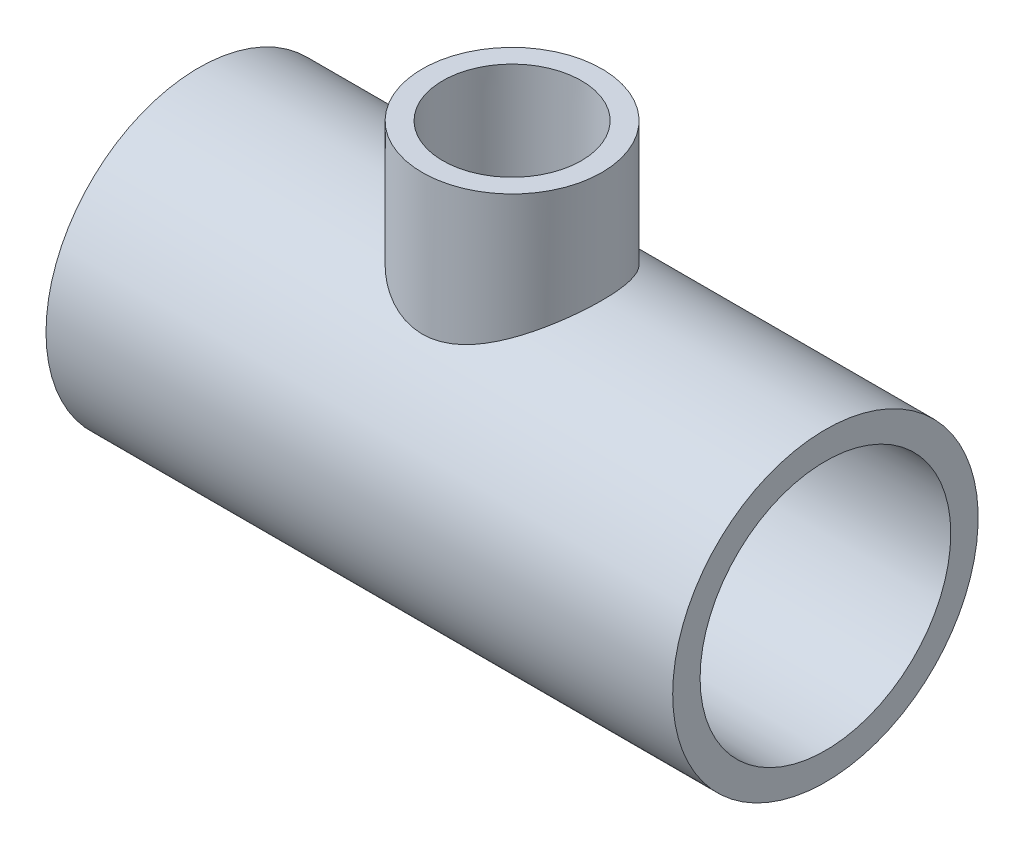
ISO-10303-21;
HEADER;
FILE_DESCRIPTION(('STEP AP214'),'2;1');
FILE_NAME('part.step','',(''),(''),'','','');
FILE_SCHEMA(('AUTOMOTIVE_DESIGN { 1 0 10303 214 1 1 1 1 }'));
ENDSEC;
DATA;
#1=APPLICATION_CONTEXT('core data for automotive mechanical design processes');
#2=APPLICATION_PROTOCOL_DEFINITION('international standard','automotive_design',2000,#1);
#3=PRODUCT_CONTEXT('',#1,'mechanical');
#4=PRODUCT('Part','Part','',(#3));
#5=PRODUCT_RELATED_PRODUCT_CATEGORY('part','',(#4));
#6=PRODUCT_DEFINITION_FORMATION('','',#4);
#7=PRODUCT_DEFINITION_CONTEXT('part definition',#1,'design');
#8=PRODUCT_DEFINITION('design','',#6,#7);
#9=PRODUCT_DEFINITION_SHAPE('','',#8);
#10=(LENGTH_UNIT() NAMED_UNIT(*) SI_UNIT(.MILLI.,.METRE.));
#11=(NAMED_UNIT(*) PLANE_ANGLE_UNIT() SI_UNIT($,.RADIAN.));
#12=(NAMED_UNIT(*) SI_UNIT($,.STERADIAN.) SOLID_ANGLE_UNIT());
#13=UNCERTAINTY_MEASURE_WITH_UNIT(LENGTH_MEASURE(1.E-05),#10,'distance_accuracy_value','');
#14=(GEOMETRIC_REPRESENTATION_CONTEXT(3) GLOBAL_UNCERTAINTY_ASSIGNED_CONTEXT((#13)) GLOBAL_UNIT_ASSIGNED_CONTEXT((#10,
#11,#12)) REPRESENTATION_CONTEXT('',''));
#15=CARTESIAN_POINT('',(0.,0.,0.));
#16=DIRECTION('',(0.,0.,1.));
#17=DIRECTION('',(1.,0.,0.));
#18=AXIS2_PLACEMENT_3D('',#15,#16,#17);
#19=CARTESIAN_POINT('',(-25.908,0.,0.));
#20=DIRECTION('',(1.,0.,0.));
#21=DIRECTION('',(0.,0.,-1.));
#22=AXIS2_PLACEMENT_3D('',#19,#20,#21);
#23=PLANE('',#22);
#24=CARTESIAN_POINT('',(-25.908,0.,0.));
#25=DIRECTION('',(-1.,0.,0.));
#26=DIRECTION('',(0.,0.,1.));
#27=AXIS2_PLACEMENT_3D('',#24,#25,#26);
#28=CIRCLE('',#27,24.0538);
#29=CARTESIAN_POINT('',(-25.908,0.,24.0538));
#30=VERTEX_POINT('',#29);
#31=EDGE_CURVE('E90',#30,#30,#28,.T.);
#32=ORIENTED_EDGE('',*,*,#31,.T.);
#33=EDGE_LOOP('',(#32));
#34=FACE_BOUND('',#33,.T.);
#35=CARTESIAN_POINT('',(-25.908,0.,0.));
#36=DIRECTION('',(1.,0.,0.));
#37=DIRECTION('',(0.,0.,-1.));
#38=AXIS2_PLACEMENT_3D('',#35,#36,#37);
#39=CIRCLE('',#38,19.05);
#40=CARTESIAN_POINT('',(-25.908,0.,-19.05));
#41=VERTEX_POINT('',#40);
#42=EDGE_CURVE('E93',#41,#41,#39,.T.);
#43=ORIENTED_EDGE('',*,*,#42,.T.);
#44=EDGE_LOOP('',(#43));
#45=FACE_BOUND('',#44,.T.);
#46=ADVANCED_FACE('F28',(#34,#45),#23,.F.);
#47=CARTESIAN_POINT('',(25.908,0.,0.));
#48=DIRECTION('',(1.,0.,0.));
#49=DIRECTION('',(0.,0.,-1.));
#50=AXIS2_PLACEMENT_3D('',#47,#48,#49);
#51=PLANE('',#50);
#52=CARTESIAN_POINT('',(25.908,0.,0.));
#53=DIRECTION('',(1.,0.,0.));
#54=DIRECTION('',(0.,0.,-1.));
#55=AXIS2_PLACEMENT_3D('',#52,#53,#54);
#56=CIRCLE('',#55,24.0538);
#57=CARTESIAN_POINT('',(25.908,0.,-24.0538));
#58=VERTEX_POINT('',#57);
#59=EDGE_CURVE('E10',#58,#58,#56,.F.);
#60=ORIENTED_EDGE('',*,*,#59,.F.);
#61=EDGE_LOOP('',(#60));
#62=FACE_BOUND('',#61,.T.);
#63=CARTESIAN_POINT('',(25.908,0.,0.));
#64=DIRECTION('',(1.,0.,0.));
#65=DIRECTION('',(0.,0.,-1.));
#66=AXIS2_PLACEMENT_3D('',#63,#64,#65);
#67=CIRCLE('',#66,19.05);
#68=CARTESIAN_POINT('',(25.908,0.,-19.05));
#69=VERTEX_POINT('',#68);
#70=EDGE_CURVE('E96',#69,#69,#67,.T.);
#71=ORIENTED_EDGE('',*,*,#70,.F.);
#72=EDGE_LOOP('',(#71));
#73=FACE_BOUND('',#72,.T.);
#74=ADVANCED_FACE('F66',(#62,#73),#51,.T.);
#75=CARTESIAN_POINT('',(25.908,0.,0.));
#76=DIRECTION('',(-1.,0.,0.));
#77=DIRECTION('',(0.,0.,1.));
#78=AXIS2_PLACEMENT_3D('',#75,#76,#77);
#79=CYLINDRICAL_SURFACE('',#78,29.591);
#80=CARTESIAN_POINT('',(-60.706,0.,0.));
#81=DIRECTION('',(-1.,0.,0.));
#82=DIRECTION('',(0.,0.,1.));
#83=AXIS2_PLACEMENT_3D('',#80,#81,#82);
#84=CIRCLE('',#83,29.591);
#85=CARTESIAN_POINT('',(-60.706,0.,29.591));
#86=VERTEX_POINT('',#85);
#87=EDGE_CURVE('E107',#86,#86,#84,.T.);
#88=ORIENTED_EDGE('',*,*,#87,.F.);
#89=EDGE_LOOP('',(#88));
#90=FACE_BOUND('',#89,.T.);
#91=CARTESIAN_POINT('',(60.706,0.,0.));
#92=DIRECTION('',(-1.,0.,0.));
#93=DIRECTION('',(0.,0.,1.));
#94=AXIS2_PLACEMENT_3D('',#91,#92,#93);
#95=CIRCLE('',#94,29.591);
#96=CARTESIAN_POINT('',(60.706,0.,29.591));
#97=VERTEX_POINT('',#96);
#98=EDGE_CURVE('E95',#97,#97,#95,.T.);
#99=ORIENTED_EDGE('',*,*,#98,.T.);
#100=EDGE_LOOP('',(#99));
#101=FACE_BOUND('',#100,.T.);
#102=CARTESIAN_POINT('',(17.399,29.591,0.));
#103=CARTESIAN_POINT('',(17.3989965746656,29.5909968547931,-0.446664263788673));
#104=CARTESIAN_POINT('',(17.3817716950422,29.5808599173466,-0.893483619711497));
#105=CARTESIAN_POINT('',(17.3130851748739,29.5405525594495,-1.78377449229501));
#106=CARTESIAN_POINT('',(17.2616010772573,29.5103689983717,-2.22724361989634));
#107=CARTESIAN_POINT('',(17.1249205436222,29.4306285259771,-3.10829157522697));
#108=CARTESIAN_POINT('',(17.0396434612983,29.381025273377,-3.54585370388858));
#109=CARTESIAN_POINT('',(16.8365009384491,29.2636801942943,-4.41075641610078));
#110=CARTESIAN_POINT('',(16.7186405534614,29.195941181759,-4.83809857418761));
#111=CARTESIAN_POINT('',(16.4523864578326,29.0442970785563,-5.67778349241128));
#112=CARTESIAN_POINT('',(16.3041469685307,28.960473772525,-6.09019009433338));
#113=CARTESIAN_POINT('',(15.9783265080964,28.7783036112216,-6.89991037613747));
#114=CARTESIAN_POINT('',(15.8007445062871,28.6799562457944,-7.29722352524792));
#115=CARTESIAN_POINT('',(15.417952544002,28.4708562205587,-8.07462602232387));
#116=CARTESIAN_POINT('',(15.2127560773021,28.3601096240342,-8.45472366213837));
#117=CARTESIAN_POINT('',(14.7762443765361,28.1283712213738,-9.19635720524652));
#118=CARTESIAN_POINT('',(14.5449265172563,28.0073783857917,-9.55789123756694));
#119=CARTESIAN_POINT('',(14.0394793333617,27.748126558282,-10.2873491853061));
#120=CARTESIAN_POINT('',(13.7634428055843,27.609252931579,-10.6537332565626));
#121=CARTESIAN_POINT('',(13.18465615595,27.3253295974633,-11.3621874909861));
#122=CARTESIAN_POINT('',(12.8819048820624,27.1802796238453,-11.70425660446));
#123=CARTESIAN_POINT('',(12.2508347272961,26.8869278142573,-12.3632776276872));
#124=CARTESIAN_POINT('',(11.9224861199397,26.7386223456033,-12.680199445528));
#125=CARTESIAN_POINT('',(11.2418805583162,26.4421655726438,-13.2873364483088));
#126=CARTESIAN_POINT('',(10.8896223466983,26.2940142768624,-13.5775502268411));
#127=CARTESIAN_POINT('',(10.1199331921776,25.9841669109285,-14.1623528553039));
#128=CARTESIAN_POINT('',(9.69969563382477,25.8229098878933,-14.4534936642856));
#129=CARTESIAN_POINT('',(8.83258042492793,25.5098630349156,-14.9991046605458));
#130=CARTESIAN_POINT('',(8.38569865646792,25.3580746758307,-15.2535691585503));
#131=CARTESIAN_POINT('',(7.46786840915121,25.0695358990769,-15.723280516061));
#132=CARTESIAN_POINT('',(6.99695170011867,24.9327663466049,-15.9385775124567));
#133=CARTESIAN_POINT('',(6.03309183371566,24.6796348682849,-16.3277946055125));
#134=CARTESIAN_POINT('',(5.5401565462078,24.563265723026,-16.5017293474795));
#135=CARTESIAN_POINT('',(4.65275524424181,24.3804848044472,-16.7701845883971));
#136=CARTESIAN_POINT('',(4.26210615512665,24.3087505052862,-16.8737658714764));
#137=CARTESIAN_POINT('',(3.47186551006263,24.182719236169,-17.0538996289054));
#138=CARTESIAN_POINT('',(3.07227531591813,24.1284196298438,-17.130456189945));
#139=CARTESIAN_POINT('',(2.26698346930766,24.0391628728771,-17.2554874469854));
#140=CARTESIAN_POINT('',(1.86128831970376,24.004186456866,-17.3039901152075));
#141=CARTESIAN_POINT('',(1.04622107477816,23.9547744465798,-17.3723302363024));
#142=CARTESIAN_POINT('',(0.636848911491327,23.9403392327732,-17.392167158222));
#143=CARTESIAN_POINT('',(-0.183170986888116,23.9325564723725,-17.402875316488));
#144=CARTESIAN_POINT('',(-0.593819708148509,23.9392446710061,-17.3936974537302));
#145=CARTESIAN_POINT('',(-1.41255916154233,23.9735289517119,-17.346412618511));
#146=CARTESIAN_POINT('',(-1.82064988209232,24.0011251283933,-17.3083055151442));
#147=CARTESIAN_POINT('',(-2.63155660073567,24.0762132177497,-17.2037019825753));
#148=CARTESIAN_POINT('',(-3.03436917745361,24.1237174351664,-17.1371879951888));
#149=CARTESIAN_POINT('',(-3.83185036098813,24.2369410670221,-16.9766777085311));
#150=CARTESIAN_POINT('',(-4.22651877590705,24.3026609101433,-16.8826807624797));
#151=CARTESIAN_POINT('',(-5.00195096147245,24.449497631376,-16.6693111828854));
#152=CARTESIAN_POINT('',(-5.38280893143271,24.5304680884988,-16.5501786651237));
#153=CARTESIAN_POINT('',(-6.13280410945582,24.7058768579449,-16.2871698929305));
#154=CARTESIAN_POINT('',(-6.50193743007998,24.8003195813158,-16.1432855311366));
#155=CARTESIAN_POINT('',(-7.22705000103735,25.0002167198022,-15.8319503259858));
#156=CARTESIAN_POINT('',(-7.5830283203365,25.1056719123027,-15.664497818631));
#157=CARTESIAN_POINT('',(-8.28076069034228,25.3251532026764,-15.3071182552408));
#158=CARTESIAN_POINT('',(-8.62251398891438,25.4391797528598,-15.1171900128574));
#159=CARTESIAN_POINT('',(-9.34743105043381,25.6932408774167,-14.6819075911772));
#160=CARTESIAN_POINT('',(-9.72783341125569,25.834414272369,-14.4326108453873));
#161=CARTESIAN_POINT('',(-10.4667000406405,26.1216007917485,-13.906083949146));
#162=CARTESIAN_POINT('',(-10.8251679811925,26.2676130997607,-13.6288584948509));
#163=CARTESIAN_POINT('',(-11.5194037588907,26.5612446028436,-13.0473653366527));
#164=CARTESIAN_POINT('',(-11.8551494899446,26.7088652050323,-12.7430719462372));
#165=CARTESIAN_POINT('',(-12.5022950243176,27.0023386845443,-12.1088032493395));
#166=CARTESIAN_POINT('',(-12.8136935648323,27.1481914698459,-11.7788266125253));
#167=CARTESIAN_POINT('',(-13.4490747524633,27.4534585372452,-11.050347615996));
#168=CARTESIAN_POINT('',(-13.7695404080466,27.6122098948425,-10.6484864685149));
#169=CARTESIAN_POINT('',(-14.375358588756,27.9192555958272,-9.81527331455823));
#170=CARTESIAN_POINT('',(-14.6607076282546,28.0675489005399,-9.38391838717003));
#171=CARTESIAN_POINT('',(-15.1935550080529,28.3495169359491,-8.49410741444208));
#172=CARTESIAN_POINT('',(-15.441068956411,28.4831976882225,-8.03566265324478));
#173=CARTESIAN_POINT('',(-15.8955648002813,28.7321231201475,-7.09431384450719));
#174=CARTESIAN_POINT('',(-16.1025517538802,28.8473701001493,-6.61141285877658));
#175=CARTESIAN_POINT('',(-16.460957046543,29.0490056131473,-5.65724266500031));
#176=CARTESIAN_POINT('',(-16.6151416690875,29.1367969762516,-5.18730999615828));
#177=CARTESIAN_POINT('',(-16.8835844748139,29.2907048808839,-4.23267677349769));
#178=CARTESIAN_POINT('',(-16.9978439509851,29.3568221243313,-3.74797669847937));
#179=CARTESIAN_POINT('',(-17.1845681925219,29.4653303350277,-2.76842601051983));
#180=CARTESIAN_POINT('',(-17.2570713751992,29.5077431101857,-2.27358516302387));
#181=CARTESIAN_POINT('',(-17.3592095128774,29.5675920351085,-1.27802031914324));
#182=CARTESIAN_POINT('',(-17.3888499491436,29.5850313784595,-0.7772970832527));
#183=CARTESIAN_POINT('',(-17.4037335703595,29.5937838498572,0.159932073074027));
#184=CARTESIAN_POINT('',(-17.3942405314551,29.5881945750429,0.596336485935011));
#185=CARTESIAN_POINT('',(-17.3425628256558,29.5578435633911,1.46650052629275));
#186=CARTESIAN_POINT('',(-17.3003815741966,29.533083829584,1.90026042533028));
#187=CARTESIAN_POINT('',(-17.183885962684,29.4649926439974,2.76193824720278));
#188=CARTESIAN_POINT('',(-17.1095721975676,29.421661536069,3.18985627804925));
#189=CARTESIAN_POINT('',(-16.9297403562719,29.3174491069984,4.03689990040177));
#190=CARTESIAN_POINT('',(-16.8242214244781,29.2565673046349,4.45602525048378));
#191=CARTESIAN_POINT('',(-16.5853923195237,29.1198886253071,5.27529396642916));
#192=CARTESIAN_POINT('',(-16.4526217036858,29.0443827218165,5.67564383191115));
#193=CARTESIAN_POINT('',(-16.1595160709122,28.8793589583378,6.46310708283081));
#194=CARTESIAN_POINT('',(-15.9991817616653,28.7898414580982,6.85022080779627));
#195=CARTESIAN_POINT('',(-15.6523531401934,28.5985544219556,7.60941758252167));
#196=CARTESIAN_POINT('',(-15.4658568707956,28.4967839694916,7.9814995050697));
#197=CARTESIAN_POINT('',(-15.0681246171143,28.2828985367166,8.70911997128292));
#198=CARTESIAN_POINT('',(-14.8568857029643,28.1707823316614,9.06465654877433));
#199=CARTESIAN_POINT('',(-14.3878098643102,27.9260994213197,9.79403982834691));
#200=CARTESIAN_POINT('',(-14.1274109576203,27.7926191202922,10.1659336025434));
#201=CARTESIAN_POINT('',(-13.5798504602151,27.5183260467884,10.8865833189193));
#202=CARTESIAN_POINT('',(-13.2926872953399,27.3775128432371,11.2353378980819));
#203=CARTESIAN_POINT('',(-12.692818891668,27.09133010119,11.908868125047));
#204=CARTESIAN_POINT('',(-12.3800863778009,26.9459558019036,12.2336174444248));
#205=CARTESIAN_POINT('',(-11.7307242171677,26.6538530368038,12.8576084414388));
#206=CARTESIAN_POINT('',(-11.394093804887,26.5071245277425,13.1568493012932));
#207=CARTESIAN_POINT('',(-10.6554310385994,26.1976034974641,13.7638177004128));
#208=CARTESIAN_POINT('',(-10.2504421926362,26.035049260963,14.0680804244378));
#209=CARTESIAN_POINT('',(-9.41348172310059,25.7170349848117,14.6413413781848));
#210=CARTESIAN_POINT('',(-8.98150594827487,25.5615760429886,14.9103341627046));
#211=CARTESIAN_POINT('',(-8.09279373061582,25.2630245882162,15.4107656643246));
#212=CARTESIAN_POINT('',(-7.63608115340961,25.1199204895769,15.6422397471565));
#213=CARTESIAN_POINT('',(-6.69973271093483,24.8513100237714,16.0655707252056));
#214=CARTESIAN_POINT('',(-6.22010396736232,24.7257982364991,16.2574398311744));
#215=CARTESIAN_POINT('',(-5.34659389220293,24.5224126037075,16.5621399943347));
#216=CARTESIAN_POINT('',(-4.95656255712508,24.4401045091803,16.6830916186141));
#217=CARTESIAN_POINT('',(-4.16600586764178,24.2921186561806,16.8978486504583));
#218=CARTESIAN_POINT('',(-3.76548196334606,24.2264386128938,16.9916577878501));
#219=CARTESIAN_POINT('',(-2.95665651625204,24.1139737296945,17.1508913040656));
#220=CARTESIAN_POINT('',(-2.5483639956226,24.0671682232272,17.2163467344627));
#221=CARTESIAN_POINT('',(-1.72631297213413,23.9940550573819,17.3180989802318));
#222=CARTESIAN_POINT('',(-1.31255441419512,23.9677476047185,17.3543955015482));
#223=CARTESIAN_POINT('',(-0.481436826144142,23.9366021264239,17.3973296488002));
#224=CARTESIAN_POINT('',(-0.0640707179942435,23.9318287545176,17.4038779593948));
#225=CARTESIAN_POINT('',(0.769727069320339,23.9441179301538,17.3869664269358));
#226=CARTESIAN_POINT('',(1.18615874560217,23.9611805449708,17.3635064914298));
#227=CARTESIAN_POINT('',(2.01506342727834,24.0164824172342,17.2869333422075));
#228=CARTESIAN_POINT('',(2.42753428161926,24.0547325852393,17.2338048505137));
#229=CARTESIAN_POINT('',(3.24535475657933,24.1509723683366,17.0986744360324));
#230=CARTESIAN_POINT('',(3.6507043024898,24.2089621903849,17.0166722105243));
#231=CARTESIAN_POINT('',(4.43782918502563,24.340317012428,16.8282185728146));
#232=CARTESIAN_POINT('',(4.81993428509567,24.4130778869863,16.7227155000701));
#233=CARTESIAN_POINT('',(5.57344176531732,24.5729465048072,16.4868996482894));
#234=CARTESIAN_POINT('',(5.94484061661545,24.6600589163171,16.3565787944032));
#235=CARTESIAN_POINT('',(6.67537149679943,24.8462848567974,16.0722825827001));
#236=CARTESIAN_POINT('',(7.03450263809015,24.945399251789,15.918305517718));
#237=CARTESIAN_POINT('',(7.73933200083425,25.1532485337519,15.5877988759396));
#238=CARTESIAN_POINT('',(8.08502959537253,25.261983868938,15.4112682482608));
#239=CARTESIAN_POINT('',(8.81458010276175,25.5041728760546,15.0076007942296));
#240=CARTESIAN_POINT('',(9.19603836116555,25.6388450879914,14.7768613553395));
#241=CARTESIAN_POINT('',(9.93851164261207,25.9144217711739,14.2880625246462));
#242=CARTESIAN_POINT('',(10.2995299324729,26.0553252400608,14.0300075175802));
#243=CARTESIAN_POINT('',(11.0003885830906,26.3402361053555,13.4875191761485));
#244=CARTESIAN_POINT('',(11.3402113912079,26.4842459448478,13.2030644518539));
#245=CARTESIAN_POINT('',(11.9972209364959,26.772153366898,12.6090462009431));
#246=CARTESIAN_POINT('',(12.3144063679841,26.9160509425081,12.2994812282103));
#247=CARTESIAN_POINT('',(12.9697139080606,27.2216760138727,11.6090589301529));
#248=CARTESIAN_POINT('',(13.304077907426,27.3829212028489,11.2244060536504));
#249=CARTESIAN_POINT('',(13.9392784134358,27.6971004350157,10.4250821706966));
#250=CARTESIAN_POINT('',(14.2401110256226,27.8500335117526,10.010407686633));
#251=CARTESIAN_POINT('',(14.8059126742722,28.1435358758749,9.15282041409932));
#252=CARTESIAN_POINT('',(15.0708666505924,28.2840999627319,8.70989588164738));
#253=CARTESIAN_POINT('',(15.5620557452478,28.5488504666771,7.79843139624327));
#254=CARTESIAN_POINT('',(15.7882963924149,28.6730392218209,7.32989511365701));
#255=CARTESIAN_POINT('',(16.1904550933099,28.8964736446356,6.39091984776526));
#256=CARTESIAN_POINT('',(16.3681205377625,28.9965630893886,5.92143151989442));
#257=CARTESIAN_POINT('',(16.6831364445004,29.1755428386295,4.96503787433314));
#258=CARTESIAN_POINT('',(16.8204799386022,29.2544294787844,4.47812956252299));
#259=CARTESIAN_POINT('',(17.0523029088384,29.3883342499189,3.49277934489417));
#260=CARTESIAN_POINT('',(17.1469265975722,29.4434326567501,2.9943823041291));
#261=CARTESIAN_POINT('',(17.2923354387059,29.5283494909458,1.98939487330724));
#262=CARTESIAN_POINT('',(17.3431590317104,29.5581900851013,1.48281206605863));
#263=CARTESIAN_POINT('',(17.3807783248501,29.5802893246539,0.812538758447441));
#264=CARTESIAN_POINT('',(17.3876089748947,29.5843035256523,0.650140880734595));
#265=CARTESIAN_POINT('',(17.396720469854,29.5896594557198,0.325168854190197));
#266=CARTESIAN_POINT('',(17.39900124689,29.5910011449181,0.162594702765055));
#267=CARTESIAN_POINT('',(17.399,29.591,0.));
#268=B_SPLINE_CURVE_WITH_KNOTS('',3,(#102,#103,#104,#105,#106,#107,#108,#109,#110,#111,#112,
#113,#114,#115,#116,#117,#118,#119,#120,#121,#122,#123,#124,#125,#126,#127,#128,#129,#130,#131,
#132,#133,#134,#135,#136,#137,#138,#139,#140,#141,#142,#143,#144,#145,#146,#147,#148,#149,#150,
#151,#152,#153,#154,#155,#156,#157,#158,#159,#160,#161,#162,#163,#164,#165,#166,#167,#168,#169,
#170,#171,#172,#173,#174,#175,#176,#177,#178,#179,#180,#181,#182,#183,#184,#185,#186,#187,#188,
#189,#190,#191,#192,#193,#194,#195,#196,#197,#198,#199,#200,#201,#202,#203,#204,#205,#206,#207,
#208,#209,#210,#211,#212,#213,#214,#215,#216,#217,#218,#219,#220,#221,#222,#223,#224,#225,#226,
#227,#228,#229,#230,#231,#232,#233,#234,#235,#236,#237,#238,#239,#240,#241,#242,#243,#244,#245,
#246,#247,#248,#249,#250,#251,#252,#253,#254,#255,#256,#257,#258,#259,#260,#261,#262,#263,#264,
#265,#266,#267),.UNSPECIFIED.,.T.,.F.,(4,2,2,2,2,2,2,2,2,2,2,2,2,2,2,2,2,2,2,2,2,2,2,2,2,2,2,2,
2,2,2,2,2,2,2,2,2,2,2,2,2,2,2,2,2,2,2,2,2,2,2,2,2,2,2,2,2,2,2,2,2,2,2,2,2,2,2,2,2,2,2,2,2,2,2,2,
2,2,2,2,2,2,4),(0.,1.33981815372604,2.68051543057583,4.0244317126321,5.36813959316862,
6.70518791766087,8.04228321692554,9.37872750260515,10.7153062213726,12.1517210832592,
13.5881979185328,15.0263685394961,16.4646148492173,18.0708456806304,19.6773254049876,
21.2817340373858,22.8855737414306,24.115727323007,25.3456948004713,26.5744337675986,
27.803195493405,29.0340376542115,30.2648853846434,31.4964950008306,32.7281336038889,
33.9485000509373,35.1692669876357,36.3901201582516,37.6110377985393,39.0382732954857,
40.4652692049367,41.8936340316022,43.322072893516,44.9338999869598,46.5458869393459,
48.1572070958271,49.7683260185458,51.2730888400343,52.7778029247535,54.2811303969759,
55.7842656074777,57.09227764214,58.400153027273,59.7080041979908,61.0158912320087,
62.3000241525773,63.5841241083694,64.868320178793,66.1526684695755,67.5708586227457,
68.9891322405322,70.4089389925305,71.8287912453417,73.42288063689,75.017215845251,
76.6100393561053,78.2023710419259,79.450839352726,80.6991360217395,81.9460621405234,
83.1930008338878,84.443680843588,85.6943647065199,86.9456932103137,88.1970348337956,
89.4049044805911,90.6131678000479,91.8215183555781,93.0299252347037,94.4256937219024,
95.8212384969832,97.2179240280965,98.6146900524837,100.216427617583,101.818351020905,
103.420944764753,105.023309443318,106.556676973052,108.09030933386,109.618725053909,
111.14579800904,111.633511269705,112.121231806415),.UNSPECIFIED.);
#269=CARTESIAN_POINT('',(17.399,29.591,0.));
#270=VERTEX_POINT('',#269);
#271=EDGE_CURVE('E50',#270,#270,#268,.T.);
#272=ORIENTED_EDGE('',*,*,#271,.F.);
#273=EDGE_LOOP('',(#272));
#274=FACE_BOUND('',#273,.T.);
#275=ADVANCED_FACE('F62',(#90,#101,#274),#79,.T.);
#276=CARTESIAN_POINT('',(0.,0.,0.));
#277=DIRECTION('',(0.,-1.,0.));
#278=DIRECTION('',(1.,0.,0.));
#279=AXIS2_PLACEMENT_3D('',#276,#277,#278);
#280=CYLINDRICAL_SURFACE('',#279,17.399);
#281=CARTESIAN_POINT('',(0.,51.054,0.));
#282=DIRECTION('',(0.,-1.,0.));
#283=DIRECTION('',(1.,0.,0.));
#284=AXIS2_PLACEMENT_3D('',#281,#282,#283);
#285=CIRCLE('',#284,17.399);
#286=CARTESIAN_POINT('',(17.399,51.054,0.));
#287=VERTEX_POINT('',#286);
#288=EDGE_CURVE('E41',#287,#287,#285,.T.);
#289=ORIENTED_EDGE('',*,*,#288,.T.);
#290=EDGE_LOOP('',(#289));
#291=FACE_BOUND('',#290,.T.);
#292=ORIENTED_EDGE('',*,*,#271,.T.);
#293=EDGE_LOOP('',(#292));
#294=FACE_BOUND('',#293,.T.);
#295=ADVANCED_FACE('F59',(#291,#294),#280,.T.);
#296=CARTESIAN_POINT('',(0.,51.054,0.));
#297=DIRECTION('',(0.,1.,0.));
#298=DIRECTION('',(-1.,0.,0.));
#299=AXIS2_PLACEMENT_3D('',#296,#297,#298);
#300=CONICAL_SURFACE('',#299,13.4366,0.00594052417839499);
#301=CARTESIAN_POINT('',(0.,51.054,0.));
#302=DIRECTION('',(0.,-1.,0.));
#303=DIRECTION('',(1.,0.,0.));
#304=AXIS2_PLACEMENT_3D('',#301,#302,#303);
#305=CIRCLE('',#304,13.4366);
#306=CARTESIAN_POINT('',(13.4366,51.054,0.));
#307=VERTEX_POINT('',#306);
#308=EDGE_CURVE('E45',#307,#307,#305,.T.);
#309=ORIENTED_EDGE('',*,*,#308,.F.);
#310=EDGE_LOOP('',(#309));
#311=FACE_BOUND('',#310,.T.);
#312=CARTESIAN_POINT('',(0.,25.4,0.));
#313=DIRECTION('',(0.,-1.,0.));
#314=DIRECTION('',(1.,0.,0.));
#315=AXIS2_PLACEMENT_3D('',#312,#313,#314);
#316=CIRCLE('',#315,13.2842);
#317=CARTESIAN_POINT('',(13.2842,25.4,0.));
#318=VERTEX_POINT('',#317);
#319=EDGE_CURVE('E150',#318,#318,#316,.T.);
#320=ORIENTED_EDGE('',*,*,#319,.T.);
#321=EDGE_LOOP('',(#320));
#322=FACE_BOUND('',#321,.T.);
#323=ADVANCED_FACE('F69',(#311,#322),#300,.F.);
#324=CARTESIAN_POINT('',(17.399,51.054,0.));
#325=DIRECTION('',(0.,1.,0.));
#326=DIRECTION('',(-1.,0.,0.));
#327=AXIS2_PLACEMENT_3D('',#324,#325,#326);
#328=PLANE('',#327);
#329=ORIENTED_EDGE('',*,*,#308,.T.);
#330=EDGE_LOOP('',(#329));
#331=FACE_BOUND('',#330,.T.);
#332=ORIENTED_EDGE('',*,*,#288,.F.);
#333=EDGE_LOOP('',(#332));
#334=FACE_BOUND('',#333,.T.);
#335=ADVANCED_FACE('F30',(#331,#334),#328,.T.);
#336=CARTESIAN_POINT('',(-60.706,-29.591,0.));
#337=DIRECTION('',(-1.,0.,0.));
#338=DIRECTION('',(0.,0.,1.));
#339=AXIS2_PLACEMENT_3D('',#336,#337,#338);
#340=PLANE('',#339);
#341=ORIENTED_EDGE('',*,*,#87,.T.);
#342=EDGE_LOOP('',(#341));
#343=FACE_BOUND('',#342,.T.);
#344=CARTESIAN_POINT('',(-60.706,0.,0.));
#345=DIRECTION('',(-1.,0.,0.));
#346=DIRECTION('',(0.,0.,1.));
#347=AXIS2_PLACEMENT_3D('',#344,#345,#346);
#348=CIRCLE('',#347,24.2824);
#349=CARTESIAN_POINT('',(-60.706,0.,24.2824));
#350=VERTEX_POINT('',#349);
#351=EDGE_CURVE('E57',#350,#350,#348,.T.);
#352=ORIENTED_EDGE('',*,*,#351,.F.);
#353=EDGE_LOOP('',(#352));
#354=FACE_BOUND('',#353,.T.);
#355=ADVANCED_FACE('F76',(#343,#354),#340,.T.);
#356=CARTESIAN_POINT('',(-25.908,0.,0.));
#357=DIRECTION('',(-1.,0.,0.));
#358=DIRECTION('',(0.,0.,1.));
#359=AXIS2_PLACEMENT_3D('',#356,#357,#358);
#360=CONICAL_SURFACE('',#359,24.0538,0.00656924856536312);
#361=ORIENTED_EDGE('',*,*,#351,.T.);
#362=EDGE_LOOP('',(#361));
#363=FACE_BOUND('',#362,.T.);
#364=ORIENTED_EDGE('',*,*,#31,.F.);
#365=EDGE_LOOP('',(#364));
#366=FACE_BOUND('',#365,.T.);
#367=ADVANCED_FACE('F112',(#363,#366),#360,.F.);
#368=CARTESIAN_POINT('',(60.706,-29.591,0.));
#369=DIRECTION('',(1.,0.,0.));
#370=DIRECTION('',(0.,0.,-1.));
#371=AXIS2_PLACEMENT_3D('',#368,#369,#370);
#372=PLANE('',#371);
#373=CARTESIAN_POINT('',(60.706,0.,0.));
#374=DIRECTION('',(-1.,0.,0.));
#375=DIRECTION('',(0.,0.,1.));
#376=AXIS2_PLACEMENT_3D('',#373,#374,#375);
#377=CIRCLE('',#376,24.2824);
#378=CARTESIAN_POINT('',(60.706,0.,24.2824));
#379=VERTEX_POINT('',#378);
#380=EDGE_CURVE('E99',#379,#379,#377,.T.);
#381=ORIENTED_EDGE('',*,*,#380,.T.);
#382=EDGE_LOOP('',(#381));
#383=FACE_BOUND('',#382,.T.);
#384=ORIENTED_EDGE('',*,*,#98,.F.);
#385=EDGE_LOOP('',(#384));
#386=FACE_BOUND('',#385,.T.);
#387=ADVANCED_FACE('F121',(#383,#386),#372,.T.);
#388=CARTESIAN_POINT('',(60.706,0.,0.));
#389=DIRECTION('',(1.,0.,0.));
#390=DIRECTION('',(0.,0.,-1.));
#391=AXIS2_PLACEMENT_3D('',#388,#389,#390);
#392=CONICAL_SURFACE('',#391,24.2824,0.00656924856536293);
#393=ORIENTED_EDGE('',*,*,#59,.T.);
#394=EDGE_LOOP('',(#393));
#395=FACE_BOUND('',#394,.T.);
#396=ORIENTED_EDGE('',*,*,#380,.F.);
#397=EDGE_LOOP('',(#396));
#398=FACE_BOUND('',#397,.T.);
#399=ADVANCED_FACE('F126',(#395,#398),#392,.F.);
#400=CARTESIAN_POINT('',(60.706,0.,0.));
#401=DIRECTION('',(1.,0.,0.));
#402=DIRECTION('',(0.,0.,-1.));
#403=AXIS2_PLACEMENT_3D('',#400,#401,#402);
#404=CYLINDRICAL_SURFACE('',#403,19.05);
#405=CARTESIAN_POINT('',(9.4234,19.05,0.));
#406=CARTESIAN_POINT('',(9.42339897824053,19.0499990754768,0.248131337728484));
#407=CARTESIAN_POINT('',(9.41358808491519,19.0451405398915,0.496284727261304));
#408=CARTESIAN_POINT('',(9.37445450632722,19.0258283757429,0.990768013201925));
#409=CARTESIAN_POINT('',(9.34512306148938,19.0113704395894,1.23709704075375));
#410=CARTESIAN_POINT('',(9.26722951849994,18.973202722697,1.72638095666143));
#411=CARTESIAN_POINT('',(9.21863587821689,18.9494777680132,1.96932963081158));
#412=CARTESIAN_POINT('',(9.1027693331464,18.8933817788057,2.44971792747523));
#413=CARTESIAN_POINT('',(9.03549504847118,18.8610101055794,2.68715714161562));
#414=CARTESIAN_POINT('',(8.88328172393525,18.7885674575911,3.15401655337843));
#415=CARTESIAN_POINT('',(8.79841386463844,18.748527555408,3.38346484126883));
#416=CARTESIAN_POINT('',(8.61165296194973,18.6616122019696,3.83397537906213));
#417=CARTESIAN_POINT('',(8.50975953568003,18.6147365969933,4.05503744023497));
#418=CARTESIAN_POINT('',(8.28984266373312,18.5152346369761,4.48751698960025));
#419=CARTESIAN_POINT('',(8.17182518338484,18.4626104101583,4.69893800623459));
#420=CARTESIAN_POINT('',(7.92045069229081,18.3527324867734,5.11128764834286));
#421=CARTESIAN_POINT('',(7.78708801638803,18.2954770827952,5.31221235871764));
#422=CARTESIAN_POINT('',(7.49754535737426,18.1740730855877,5.71421303355051));
#423=CARTESIAN_POINT('',(7.3404806599623,18.1097170556776,5.91458932732339));
#424=CARTESIAN_POINT('',(7.01107852302817,17.9787212694157,6.30157288746889));
#425=CARTESIAN_POINT('',(6.83874023168003,17.9120813858181,6.48817938481907));
#426=CARTESIAN_POINT('',(6.47960309476925,17.7780628947219,6.84687222030535));
#427=CARTESIAN_POINT('',(6.29279549832522,17.7106838616721,7.01894963784461));
#428=CARTESIAN_POINT('',(5.90567340621398,17.5768603058651,7.34765144343197));
#429=CARTESIAN_POINT('',(5.70535642737447,17.5104159576407,7.50427297741559));
#430=CARTESIAN_POINT('',(5.27646130967059,17.375229097253,7.81244731106577));
#431=CARTESIAN_POINT('',(5.04689195416616,17.3066942602976,7.96271559938776));
#432=CARTESIAN_POINT('',(4.5744910300839,17.1748825637306,8.24317406230966));
#433=CARTESIAN_POINT('',(4.33166513100397,17.1116034851069,8.3733727304998));
#434=CARTESIAN_POINT('',(3.8341052396293,16.9924715735838,8.61256452683375));
#435=CARTESIAN_POINT('',(3.57937480505368,16.9366165409189,8.72156394083003));
#436=CARTESIAN_POINT('',(3.05961145330003,16.8344401244258,8.91719258299222));
#437=CARTESIAN_POINT('',(2.79457965658598,16.7881177071797,9.00382423627612));
#438=CARTESIAN_POINT('',(2.2721765758477,16.7093433828006,9.14914040225514));
#439=CARTESIAN_POINT('',(2.01528097988528,16.6762325613734,9.20917603342146));
#440=CARTESIAN_POINT('',(1.49616097326778,16.6214903991673,9.30761757808726));
#441=CARTESIAN_POINT('',(1.2339367864851,16.5998585771472,9.34602439834875));
#442=CARTESIAN_POINT('',(0.706668764726258,16.5690135714405,9.40059984125235));
#443=CARTESIAN_POINT('',(0.441627402512291,16.5597902787465,9.41678656642838));
#444=CARTESIAN_POINT('',(-0.0890007853342831,16.5541414620486,9.42671429492923));
#445=CARTESIAN_POINT('',(-0.354587558626231,16.5577147625648,9.42045735990219));
#446=CARTESIAN_POINT('',(-0.852867693567639,16.5763332743292,9.38764924474983));
#447=CARTESIAN_POINT('',(-1.08578009541279,16.5899899402818,9.36355357591613));
#448=CARTESIAN_POINT('',(-1.5485198424912,16.6266875869062,9.29823449702514));
#449=CARTESIAN_POINT('',(-1.77834613783483,16.6497316816023,9.25700540332829));
#450=CARTESIAN_POINT('',(-2.23328260659223,16.7044478907894,9.15789902367075));
#451=CARTESIAN_POINT('',(-2.45839345660586,16.7361187582005,9.10002414394477));
#452=CARTESIAN_POINT('',(-2.90270039406976,16.8071288041294,8.96819499843693));
#453=CARTESIAN_POINT('',(-3.12189408480117,16.8464710383782,8.89423432385044));
#454=CARTESIAN_POINT('',(-3.55807816402004,16.9326665343948,8.7290420171364));
#455=CARTESIAN_POINT('',(-3.7749033861531,16.9796710568277,8.63745393427156));
#456=CARTESIAN_POINT('',(-4.20012735744607,17.0792373976819,8.43886753403507));
#457=CARTESIAN_POINT('',(-4.40852327400462,17.1318010631095,8.3318640906585));
#458=CARTESIAN_POINT('',(-4.81597992975099,17.2411474447346,8.10317198738474));
#459=CARTESIAN_POINT('',(-5.01503897794334,17.2979309204041,7.9814806815274));
#460=CARTESIAN_POINT('',(-5.40302190610802,17.4143741362262,7.72411951894604));
#461=CARTESIAN_POINT('',(-5.59194517362444,17.4740340497754,7.58844881895864));
#462=CARTESIAN_POINT('',(-5.98171967217335,17.6024165238668,7.2861261590061));
#463=CARTESIAN_POINT('',(-6.18114429145746,17.6713453912793,7.11771865621958));
#464=CARTESIAN_POINT('',(-6.56526688477584,17.8093412936653,6.76503583877416));
#465=CARTESIAN_POINT('',(-6.74996857054016,17.8784082892863,6.58076454798289));
#466=CARTESIAN_POINT('',(-7.10387628922246,18.0150054121008,6.19706206208402));
#467=CARTESIAN_POINT('',(-7.2730696101405,18.0825342450094,5.99761867134311));
#468=CARTESIAN_POINT('',(-7.59469949641481,18.2142794989546,5.58475207239357));
#469=CARTESIAN_POINT('',(-7.74714267539953,18.2784972219962,5.37133443528351));
#470=CARTESIAN_POINT('',(-8.04073209162454,18.4048107671789,4.92162523673189));
#471=CARTESIAN_POINT('',(-8.18106327859861,18.4666816974972,4.68473681544253));
#472=CARTESIAN_POINT('',(-8.44107611236239,18.5833337909237,4.19818794541441));
#473=CARTESIAN_POINT('',(-8.56075683130845,18.6381146354405,3.94852692344455));
#474=CARTESIAN_POINT('',(-8.77812765752367,18.7389511290972,3.43828260403535));
#475=CARTESIAN_POINT('',(-8.87583147580246,18.7850122154868,3.17770623755176));
#476=CARTESIAN_POINT('',(-9.04814655567361,18.8670410915406,2.64748747361076));
#477=CARTESIAN_POINT('',(-9.12276041008161,18.9030100144305,2.37784609785292));
#478=CARTESIAN_POINT('',(-9.24277912391413,18.9612363222699,1.85409777008738));
#479=CARTESIAN_POINT('',(-9.29007146132189,18.9843734564283,1.60052004556732));
#480=CARTESIAN_POINT('',(-9.36374741752675,19.0205352860686,1.08963078228823));
#481=CARTESIAN_POINT('',(-9.39013215882068,19.0335605244419,0.83231944473657));
#482=CARTESIAN_POINT('',(-9.42164111873838,19.0491250900881,0.316182363496146));
#483=CARTESIAN_POINT('',(-9.42677358128106,19.0516684833459,0.0573572460374572));
#484=CARTESIAN_POINT('',(-9.41573087046744,19.0462068350281,-0.459720547710995));
#485=CARTESIAN_POINT('',(-9.39955660150458,19.0382022411762,-0.717973247831732));
#486=CARTESIAN_POINT('',(-9.34814934468864,19.0128766283358,-1.21225283690166));
#487=CARTESIAN_POINT('',(-9.31445417332699,18.9963079004703,-1.44848043108909));
#488=CARTESIAN_POINT('',(-9.22941192852412,18.9547540051334,-1.91706562287488));
#489=CARTESIAN_POINT('',(-9.17805885034092,18.9297659746549,-2.14942187576819));
#490=CARTESIAN_POINT('',(-9.058254485075,18.8719701473405,-2.60859726882834));
#491=CARTESIAN_POINT('',(-8.98980865454866,18.8391648461816,-2.83541815074627));
#492=CARTESIAN_POINT('',(-8.83643499279375,18.766460960817,-3.28233533217646));
#493=CARTESIAN_POINT('',(-8.75150074870317,18.726559617246,-3.50242897657975));
#494=CARTESIAN_POINT('',(-8.56324110470102,18.6393126418462,-3.94079815826628));
#495=CARTESIAN_POINT('',(-8.45945898018493,18.5917866608384,-4.15884144585675));
#496=CARTESIAN_POINT('',(-8.23605034084079,18.4912035267076,-4.58540459154805));
#497=CARTESIAN_POINT('',(-8.11641845194612,18.4381444988386,-4.79392118710791));
#498=CARTESIAN_POINT('',(-7.86215967017043,18.3276424310417,-5.20042278535854));
#499=CARTESIAN_POINT('',(-7.72753023608817,18.2701986486764,-5.3984059948372));
#500=CARTESIAN_POINT('',(-7.44411486247116,18.1521426373719,-5.78296490698593));
#501=CARTESIAN_POINT('',(-7.29532821573921,18.091530250219,-5.96954003902121));
#502=CARTESIAN_POINT('',(-6.96932586332152,17.9624333909958,-6.34801027282585));
#503=CARTESIAN_POINT('',(-6.79075239888316,17.893754930844,-6.53867147899976));
#504=CARTESIAN_POINT('',(-6.41857618196134,17.7558522382939,-6.90437537373273));
#505=CARTESIAN_POINT('',(-6.22497739381835,17.6866281541567,-7.0794221560414));
#506=CARTESIAN_POINT('',(-5.82352114231055,17.5493541185803,-7.4131812435017));
#507=CARTESIAN_POINT('',(-5.61565326994066,17.4813050705813,-7.57188140851097));
#508=CARTESIAN_POINT('',(-5.18674222634115,17.3482783065085,-7.87189150433582));
#509=CARTESIAN_POINT('',(-4.96569712925348,17.2833010418777,-8.01319888389244));
#510=CARTESIAN_POINT('',(-4.50104987262755,17.1554464550711,-8.28350988906391));
#511=CARTESIAN_POINT('',(-4.25687774066037,17.0928035105168,-8.41164763231535));
#512=CARTESIAN_POINT('',(-3.75682120564242,16.975180000953,-8.64656151944173));
#513=CARTESIAN_POINT('',(-3.50094251385069,16.9201957513653,-8.75334794622245));
#514=CARTESIAN_POINT('',(-2.97925447259533,16.8200040504018,-8.94436143435227));
#515=CARTESIAN_POINT('',(-2.7134530831538,16.7747889517662,-9.02860615368514));
#516=CARTESIAN_POINT('',(-2.17381392183969,16.6959969449132,-9.173495139079));
#517=CARTESIAN_POINT('',(-1.89997736851191,16.6624182818057,-9.23414296395552));
#518=CARTESIAN_POINT('',(-1.37309986060548,16.6110017556718,-9.3262866871382));
#519=CARTESIAN_POINT('',(-1.12056362734247,16.5919688976001,-9.3600096936965));
#520=CARTESIAN_POINT('',(-0.612987448791099,16.5654334297948,-9.40689391101956));
#521=CARTESIAN_POINT('',(-0.357947673073068,16.5579300444945,-9.42005650484675));
#522=CARTESIAN_POINT('',(0.152341088077928,16.5547624438078,-9.42562194344152));
#523=CARTESIAN_POINT('',(0.407589970952524,16.5590941440355,-9.4180319500977));
#524=CARTESIAN_POINT('',(0.916159214116339,16.5794097705031,-9.38222225923339));
#525=CARTESIAN_POINT('',(1.16947964684667,16.5953932568461,-9.35400334052883));
#526=CARTESIAN_POINT('',(1.64899013261776,16.636389452462,-9.2808736088478));
#527=CARTESIAN_POINT('',(1.87553620436692,16.660438731776,-9.23773264625808));
#528=CARTESIAN_POINT('',(2.32394605790288,16.7168556618221,-9.13524258850262));
#529=CARTESIAN_POINT('',(2.54580825897742,16.7492260737007,-9.07588811290368));
#530=CARTESIAN_POINT('',(2.98349404934183,16.8213162781229,-8.94156693011412));
#531=CARTESIAN_POINT('',(3.19931840690306,16.8610351306897,-8.86660221955519));
#532=CARTESIAN_POINT('',(3.62392095181309,16.9467261833127,-8.70170091234312));
#533=CARTESIAN_POINT('',(3.83269650170815,16.9927006923819,-8.61175878464824));
#534=CARTESIAN_POINT('',(4.47437609393379,17.1447427080089,-8.3074652244034));
#535=CARTESIAN_POINT('',(4.89332536125106,17.2598981782196,-8.06758052601698));
#536=CARTESIAN_POINT('',(5.68768042060977,17.5016583545137,-7.52870708225603));
#537=CARTESIAN_POINT('',(6.06306368336649,17.6282689246798,-7.2296879709161));
#538=CARTESIAN_POINT('',(6.60951126802177,17.8256650999393,-6.72208761679903));
#539=CARTESIAN_POINT('',(6.79774496704126,17.8964768530277,-6.53168154982301));
#540=CARTESIAN_POINT('',(7.15762276565849,18.0362438667104,-6.13518790201033));
#541=CARTESIAN_POINT('',(7.32927160742277,18.105199653895,-5.92910483405638));
#542=CARTESIAN_POINT('',(7.65501039070101,18.2394950998866,-5.50213146376664));
#543=CARTESIAN_POINT('',(7.80908678238986,18.3048319484896,-5.28122994082981));
#544=CARTESIAN_POINT('',(8.09836335116611,18.4300982884361,-4.82594080523899));
#545=CARTESIAN_POINT('',(8.23356466061084,18.4900281040829,-4.59155400278864));
#546=CARTESIAN_POINT('',(8.48451887375911,18.6031309211656,-4.10945484412656));
#547=CARTESIAN_POINT('',(8.60017127799516,18.6562686836403,-3.86168178455081));
#548=CARTESIAN_POINT('',(8.809974962784,18.753908031919,-3.35556686846579));
#549=CARTESIAN_POINT('',(8.90412885495166,18.7984106666098,-3.09722630018617));
#550=CARTESIAN_POINT('',(9.06962179721367,18.8773619498159,-2.57253191029738));
#551=CARTESIAN_POINT('',(9.14101528135462,18.9118345687004,-2.3061988999093));
#552=CARTESIAN_POINT('',(9.26030607818649,18.9697804649054,-1.76728149575345));
#553=CARTESIAN_POINT('',(9.30821794324339,18.9932605542692,-1.49470108364751));
#554=CARTESIAN_POINT('',(9.37044060630513,19.0238451964419,-1.01824762334159));
#555=CARTESIAN_POINT('',(9.39028457218699,19.0336372616803,-0.815249492500585));
#556=CARTESIAN_POINT('',(9.41676486955687,19.0467151325044,-0.408172567015603));
#557=CARTESIAN_POINT('',(9.42340084042071,19.0500007604416,-0.204093743017485));
#558=CARTESIAN_POINT('',(9.4234,19.05,0.));
#559=B_SPLINE_CURVE_WITH_KNOTS('',3,(#405,#406,#407,#408,#409,#410,#411,#412,#413,#414,#415,
#416,#417,#418,#419,#420,#421,#422,#423,#424,#425,#426,#427,#428,#429,#430,#431,#432,#433,#434,
#435,#436,#437,#438,#439,#440,#441,#442,#443,#444,#445,#446,#447,#448,#449,#450,#451,#452,#453,
#454,#455,#456,#457,#458,#459,#460,#461,#462,#463,#464,#465,#466,#467,#468,#469,#470,#471,#472,
#473,#474,#475,#476,#477,#478,#479,#480,#481,#482,#483,#484,#485,#486,#487,#488,#489,#490,#491,
#492,#493,#494,#495,#496,#497,#498,#499,#500,#501,#502,#503,#504,#505,#506,#507,#508,#509,#510,
#511,#512,#513,#514,#515,#516,#517,#518,#519,#520,#521,#522,#523,#524,#525,#526,#527,#528,#529,
#530,#531,#532,#533,#534,#535,#536,#537,#538,#539,#540,#541,#542,#543,#544,#545,#546,#547,#548,
#549,#550,#551,#552,#553,#554,#555,#556,#557,#558),.UNSPECIFIED.,.T.,.F.,(4,2,2,2,2,2,2,2,2,2,2,
2,2,2,2,2,2,2,2,2,2,2,2,2,2,2,2,2,2,2,2,2,2,2,2,2,2,2,2,2,2,2,2,2,2,2,2,2,2,2,2,2,2,2,2,2,2,2,2,
2,2,2,2,2,2,2,2,2,2,2,2,2,2,2,2,2,4),(0.,0.744192465682231,1.48871910272449,2.23446998329327,
2.98027596508729,3.72312145848136,4.46598365953277,5.20857176836737,5.95143491170669,
6.73841536994254,7.5254397466408,8.31294388072678,9.10059316330869,9.94795747791535,
10.7949621921563,11.6417153743888,12.4883767128506,13.2849032310756,14.0813963533938,
14.8772401932496,15.6730109297018,16.375843513587,17.0789094331829,17.7818737719899,
18.4851186963093,19.2044543318104,19.9240297194492,20.6437349297586,21.3634835794849,
22.1724974447404,22.9813067039528,23.7907731130091,24.599918754942,25.4454109219297,
26.2909410677364,27.1359422296347,27.9808484702974,28.7567684437195,29.5326467563636,
30.3082240717589,31.0837684677721,31.8005181594156,32.5175118301674,33.2342769054155,
33.9513213136527,34.6888843391446,35.4266980879558,36.1646370434757,36.9026128807342,
37.7120395099636,38.5212532982058,39.3310637965832,40.1409929407249,40.988207731421,
41.835013510992,42.681153992618,43.5271668122666,44.2925671775757,45.0579160535446,
45.8230008346594,46.5880567325713,47.2828900518024,47.9779542312716,48.6729295628993,
49.3681621149102,50.8507843974141,52.3341700037977,53.164198737724,53.993989431876,
54.8244156987445,55.6547921251025,56.489315539314,57.3237375225686,58.1561486558492,
58.9880432609683,59.6001420003615,60.2122574519482),.UNSPECIFIED.);
#560=CARTESIAN_POINT('',(9.4234,19.05,0.));
#561=VERTEX_POINT('',#560);
#562=EDGE_CURVE('E32',#561,#561,#559,.T.);
#563=ORIENTED_EDGE('',*,*,#562,.F.);
#564=EDGE_LOOP('',(#563));
#565=FACE_BOUND('',#564,.T.);
#566=ORIENTED_EDGE('',*,*,#70,.T.);
#567=EDGE_LOOP('',(#566));
#568=FACE_BOUND('',#567,.T.);
#569=ORIENTED_EDGE('',*,*,#42,.F.);
#570=EDGE_LOOP('',(#569));
#571=FACE_BOUND('',#570,.T.);
#572=ADVANCED_FACE('F129',(#565,#568,#571),#404,.F.);
#573=CARTESIAN_POINT('',(13.2842,25.4,0.));
#574=DIRECTION('',(0.,-1.,0.));
#575=DIRECTION('',(1.,0.,0.));
#576=AXIS2_PLACEMENT_3D('',#573,#574,#575);
#577=PLANE('',#576);
#578=ORIENTED_EDGE('',*,*,#319,.F.);
#579=EDGE_LOOP('',(#578));
#580=FACE_BOUND('',#579,.T.);
#581=CARTESIAN_POINT('',(0.,25.4,0.));
#582=DIRECTION('',(0.,-1.,0.));
#583=DIRECTION('',(1.,0.,0.));
#584=AXIS2_PLACEMENT_3D('',#581,#582,#583);
#585=CIRCLE('',#584,9.4234);
#586=CARTESIAN_POINT('',(9.4234,25.4,0.));
#587=VERTEX_POINT('',#586);
#588=EDGE_CURVE('E148',#587,#587,#585,.T.);
#589=ORIENTED_EDGE('',*,*,#588,.T.);
#590=EDGE_LOOP('',(#589));
#591=FACE_BOUND('',#590,.T.);
#592=ADVANCED_FACE('F133',(#580,#591),#577,.F.);
#593=CARTESIAN_POINT('',(0.,0.,0.));
#594=DIRECTION('',(0.,-1.,0.));
#595=DIRECTION('',(1.,0.,0.));
#596=AXIS2_PLACEMENT_3D('',#593,#594,#595);
#597=CYLINDRICAL_SURFACE('',#596,9.4234);
#598=ORIENTED_EDGE('',*,*,#562,.T.);
#599=EDGE_LOOP('',(#598));
#600=FACE_BOUND('',#599,.T.);
#601=ORIENTED_EDGE('',*,*,#588,.F.);
#602=EDGE_LOOP('',(#601));
#603=FACE_BOUND('',#602,.T.);
#604=ADVANCED_FACE('F136',(#600,#603),#597,.F.);
#605=CLOSED_SHELL('',(#46,#74,#275,#295,#323,#335,#355,#367,#387,#399,#572,#592,#604));
#606=MANIFOLD_SOLID_BREP('B2',#605);
#607=ADVANCED_BREP_SHAPE_REPRESENTATION('',(#18,#606),#14);
#608=SHAPE_DEFINITION_REPRESENTATION(#9,#607);
ENDSEC;
END-ISO-10303-21;
